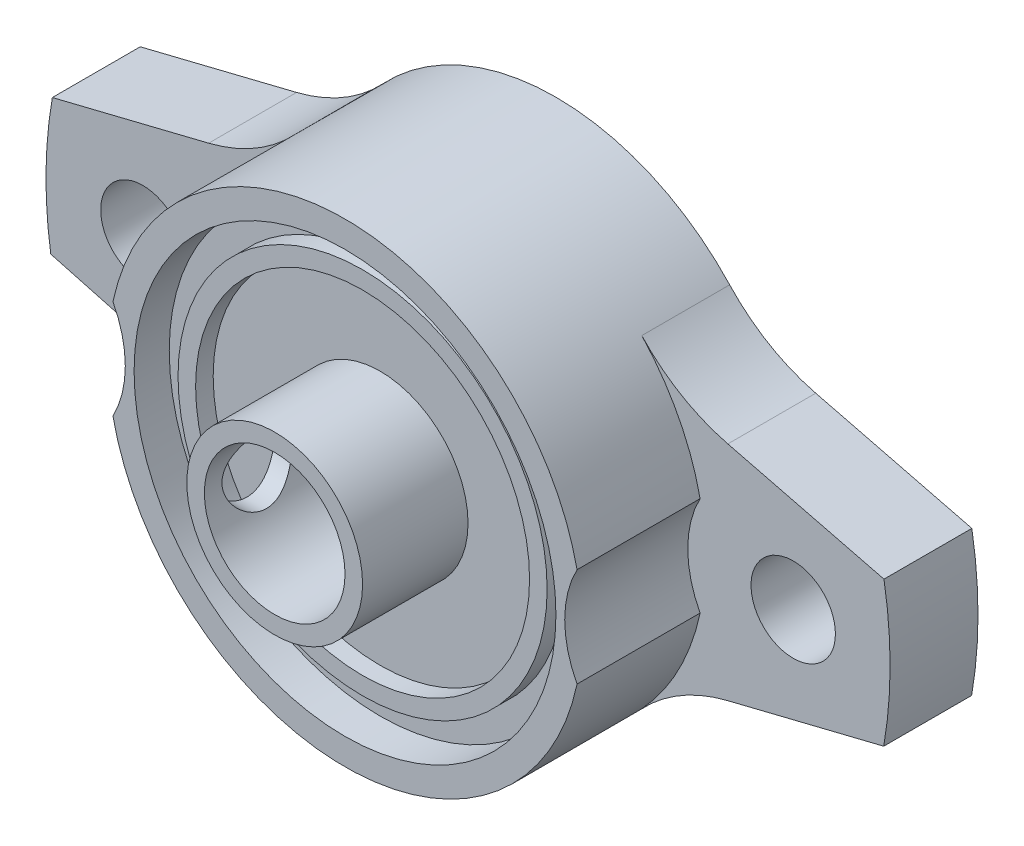
ISO-10303-21;
HEADER;
FILE_DESCRIPTION(('STEP AP214'),'2;1');
FILE_NAME('part.step','',(''),(''),'','','');
FILE_SCHEMA(('AUTOMOTIVE_DESIGN { 1 0 10303 214 1 1 1 1 }'));
ENDSEC;
DATA;
#1=APPLICATION_CONTEXT('core data for automotive mechanical design processes');
#2=APPLICATION_PROTOCOL_DEFINITION('international standard','automotive_design',2000,#1);
#3=PRODUCT_CONTEXT('',#1,'mechanical');
#4=PRODUCT('Part','Part','',(#3));
#5=PRODUCT_RELATED_PRODUCT_CATEGORY('part','',(#4));
#6=PRODUCT_DEFINITION_FORMATION('','',#4);
#7=PRODUCT_DEFINITION_CONTEXT('part definition',#1,'design');
#8=PRODUCT_DEFINITION('design','',#6,#7);
#9=PRODUCT_DEFINITION_SHAPE('','',#8);
#10=(LENGTH_UNIT() NAMED_UNIT(*) SI_UNIT(.MILLI.,.METRE.));
#11=(NAMED_UNIT(*) PLANE_ANGLE_UNIT() SI_UNIT($,.RADIAN.));
#12=(NAMED_UNIT(*) SI_UNIT($,.STERADIAN.) SOLID_ANGLE_UNIT());
#13=UNCERTAINTY_MEASURE_WITH_UNIT(LENGTH_MEASURE(1.E-05),#10,'distance_accuracy_value','');
#14=(GEOMETRIC_REPRESENTATION_CONTEXT(3) GLOBAL_UNCERTAINTY_ASSIGNED_CONTEXT((#13)) GLOBAL_UNIT_ASSIGNED_CONTEXT((#10,
#11,#12)) REPRESENTATION_CONTEXT('',''));
#15=CARTESIAN_POINT('',(0.,0.,0.));
#16=DIRECTION('',(0.,0.,1.));
#17=DIRECTION('',(1.,0.,0.));
#18=AXIS2_PLACEMENT_3D('',#15,#16,#17);
#19=CARTESIAN_POINT('',(0.,0.,10.));
#20=DIRECTION('',(0.,0.,1.));
#21=DIRECTION('',(1.,0.,0.));
#22=AXIS2_PLACEMENT_3D('',#19,#20,#21);
#23=PLANE('',#22);
#24=CARTESIAN_POINT('',(0.,0.,10.));
#25=DIRECTION('',(0.,0.,1.));
#26=DIRECTION('',(1.,0.,0.));
#27=AXIS2_PLACEMENT_3D('',#24,#25,#26);
#28=CIRCLE('',#27,5.);
#29=CARTESIAN_POINT('',(5.,0.,10.));
#30=VERTEX_POINT('',#29);
#31=EDGE_CURVE('E372',#30,#30,#28,.T.);
#32=ORIENTED_EDGE('',*,*,#31,.F.);
#33=EDGE_LOOP('',(#32));
#34=FACE_BOUND('',#33,.T.);
#35=CARTESIAN_POINT('',(0.,0.,10.));
#36=DIRECTION('',(0.,0.,1.));
#37=DIRECTION('',(1.,0.,0.));
#38=AXIS2_PLACEMENT_3D('',#35,#36,#37);
#39=CIRCLE('',#38,9.5);
#40=CARTESIAN_POINT('',(9.5,0.,10.));
#41=VERTEX_POINT('',#40);
#42=EDGE_CURVE('E11',#41,#41,#39,.F.);
#43=ORIENTED_EDGE('',*,*,#42,.F.);
#44=EDGE_LOOP('',(#43));
#45=FACE_BOUND('',#44,.T.);
#46=ADVANCED_FACE('F39',(#34,#45),#23,.T.);
#47=CARTESIAN_POINT('',(0.,0.,5.));
#48=DIRECTION('',(0.,0.,-1.));
#49=DIRECTION('',(-1.,0.,0.));
#50=AXIS2_PLACEMENT_3D('',#47,#48,#49);
#51=CYLINDRICAL_SURFACE('',#50,13.5);
#52=DIRECTION('',(0.,0.,-1.));
#53=VECTOR('',#52,1.);
#54=CARTESIAN_POINT('',(-13.2027027027027,2.81755946592911,8.5));
#55=LINE('',#54,#53);
#56=CARTESIAN_POINT('',(-13.2027027027027,2.81755946592911,12.));
#57=VERTEX_POINT('',#56);
#58=CARTESIAN_POINT('',(-13.2027027027027,2.81755946592911,5.));
#59=VERTEX_POINT('',#58);
#60=EDGE_CURVE('E365',#57,#59,#55,.T.);
#61=ORIENTED_EDGE('',*,*,#60,.F.);
#62=CARTESIAN_POINT('',(0.,0.,12.));
#63=DIRECTION('',(0.,0.,1.));
#64=DIRECTION('',(1.,0.,0.));
#65=AXIS2_PLACEMENT_3D('',#62,#63,#64);
#66=CIRCLE('',#65,13.5);
#67=CARTESIAN_POINT('',(13.2027027027027,2.81755946592911,12.));
#68=VERTEX_POINT('',#67);
#69=EDGE_CURVE('E181',#68,#57,#66,.T.);
#70=ORIENTED_EDGE('',*,*,#69,.F.);
#71=DIRECTION('',(0.,0.,-1.));
#72=VECTOR('',#71,1.);
#73=CARTESIAN_POINT('',(13.2027027027027,2.81755946592912,8.5));
#74=LINE('',#73,#72);
#75=CARTESIAN_POINT('',(13.2027027027027,2.81755946592912,5.));
#76=VERTEX_POINT('',#75);
#77=EDGE_CURVE('E69',#76,#68,#74,.F.);
#78=ORIENTED_EDGE('',*,*,#77,.F.);
#79=CARTESIAN_POINT('',(0.,0.,5.));
#80=DIRECTION('',(0.,0.,1.));
#81=DIRECTION('',(1.,0.,0.));
#82=AXIS2_PLACEMENT_3D('',#79,#80,#81);
#83=CIRCLE('',#82,13.5);
#84=CARTESIAN_POINT('',(9.88488307514871,9.19451393987951,5.));
#85=VERTEX_POINT('',#84);
#86=EDGE_CURVE('E198',#76,#85,#83,.T.);
#87=ORIENTED_EDGE('',*,*,#86,.T.);
#88=DIRECTION('',(0.,0.,-1.));
#89=VECTOR('',#88,1.);
#90=CARTESIAN_POINT('',(9.88488307514871,9.1945139398795,5.));
#91=LINE('',#90,#89);
#92=CARTESIAN_POINT('',(9.88488307514871,9.1945139398795,0.));
#93=VERTEX_POINT('',#92);
#94=EDGE_CURVE('E288',#85,#93,#91,.T.);
#95=ORIENTED_EDGE('',*,*,#94,.T.);
#96=CARTESIAN_POINT('',(0.,0.,0.));
#97=DIRECTION('',(0.,0.,1.));
#98=DIRECTION('',(1.,0.,0.));
#99=AXIS2_PLACEMENT_3D('',#96,#97,#98);
#100=CIRCLE('',#99,13.5);
#101=CARTESIAN_POINT('',(-9.85452897471219,9.22703954074966,0.));
#102=VERTEX_POINT('',#101);
#103=EDGE_CURVE('E220',#93,#102,#100,.T.);
#104=ORIENTED_EDGE('',*,*,#103,.T.);
#105=DIRECTION('',(0.,0.,-1.));
#106=VECTOR('',#105,1.);
#107=CARTESIAN_POINT('',(-9.85452897471219,9.22703954074966,5.));
#108=LINE('',#107,#106);
#109=CARTESIAN_POINT('',(-9.85452897471219,9.22703954074966,5.));
#110=VERTEX_POINT('',#109);
#111=EDGE_CURVE('E249',#110,#102,#108,.T.);
#112=ORIENTED_EDGE('',*,*,#111,.F.);
#113=EDGE_CURVE('E192',#110,#59,#83,.T.);
#114=ORIENTED_EDGE('',*,*,#113,.T.);
#115=EDGE_LOOP('',(#61,#70,#78,#87,#95,#104,#112,#114));
#116=FACE_BOUND('',#115,.T.);
#117=ADVANCED_FACE('F383',(#116),#51,.T.);
#118=DIRECTION('',(0.,0.,-1.));
#119=VECTOR('',#118,1.);
#120=CARTESIAN_POINT('',(-13.2027027027027,-2.81755946592911,8.5));
#121=LINE('',#120,#119);
#122=CARTESIAN_POINT('',(-13.2027027027027,-2.81755946592911,5.));
#123=VERTEX_POINT('',#122);
#124=CARTESIAN_POINT('',(-13.2027027027027,-2.81755946592911,12.));
#125=VERTEX_POINT('',#124);
#126=EDGE_CURVE('E61',#123,#125,#121,.F.);
#127=ORIENTED_EDGE('',*,*,#126,.F.);
#128=CARTESIAN_POINT('',(-10.0813645713589,-8.97864624424808,5.));
#129=VERTEX_POINT('',#128);
#130=EDGE_CURVE('E197',#123,#129,#83,.T.);
#131=ORIENTED_EDGE('',*,*,#130,.T.);
#132=DIRECTION('',(0.,0.,-1.));
#133=VECTOR('',#132,1.);
#134=CARTESIAN_POINT('',(-10.0813645713589,-8.97864624424808,5.));
#135=LINE('',#134,#133);
#136=CARTESIAN_POINT('',(-10.0813645713589,-8.97864624424808,0.));
#137=VERTEX_POINT('',#136);
#138=EDGE_CURVE('E312',#129,#137,#135,.T.);
#139=ORIENTED_EDGE('',*,*,#138,.T.);
#140=CARTESIAN_POINT('',(0.,0.,0.));
#141=DIRECTION('',(0.,0.,1.));
#142=DIRECTION('',(1.,0.,0.));
#143=AXIS2_PLACEMENT_3D('',#140,#141,#142);
#144=CIRCLE('',#143,13.5);
#145=CARTESIAN_POINT('',(9.85452897471219,-9.22703954074967,0.));
#146=VERTEX_POINT('',#145);
#147=EDGE_CURVE('E265',#137,#146,#144,.T.);
#148=ORIENTED_EDGE('',*,*,#147,.T.);
#149=DIRECTION('',(0.,0.,-1.));
#150=VECTOR('',#149,1.);
#151=CARTESIAN_POINT('',(9.85452897471219,-9.22703954074967,5.));
#152=LINE('',#151,#150);
#153=CARTESIAN_POINT('',(9.85452897471219,-9.22703954074967,5.));
#154=VERTEX_POINT('',#153);
#155=EDGE_CURVE('E308',#154,#146,#152,.T.);
#156=ORIENTED_EDGE('',*,*,#155,.F.);
#157=CARTESIAN_POINT('',(13.2027027027027,-2.81755946592912,5.));
#158=VERTEX_POINT('',#157);
#159=EDGE_CURVE('E175',#154,#158,#83,.T.);
#160=ORIENTED_EDGE('',*,*,#159,.T.);
#161=DIRECTION('',(0.,0.,-1.));
#162=VECTOR('',#161,1.);
#163=CARTESIAN_POINT('',(13.2027027027027,-2.81755946592912,8.5));
#164=LINE('',#163,#162);
#165=CARTESIAN_POINT('',(13.2027027027027,-2.81755946592911,12.));
#166=VERTEX_POINT('',#165);
#167=EDGE_CURVE('E159',#166,#158,#164,.T.);
#168=ORIENTED_EDGE('',*,*,#167,.F.);
#169=EDGE_CURVE('E173',#125,#166,#66,.T.);
#170=ORIENTED_EDGE('',*,*,#169,.F.);
#171=EDGE_LOOP('',(#127,#131,#139,#148,#156,#160,#168,#170));
#172=FACE_BOUND('',#171,.T.);
#173=ADVANCED_FACE('F172',(#172),#51,.T.);
#174=CARTESIAN_POINT('',(-17.1541800670916,16.0618836450087,5.));
#175=DIRECTION('',(0.,0.,-1.));
#176=DIRECTION('',(-1.,0.,0.));
#177=AXIS2_PLACEMENT_3D('',#174,#175,#176);
#178=PLANE('',#177);
#179=CARTESIAN_POINT('',(0.,0.,5.));
#180=DIRECTION('',(0.,0.,1.));
#181=DIRECTION('',(1.,0.,0.));
#182=AXIS2_PLACEMENT_3D('',#179,#180,#181);
#183=CIRCLE('',#182,24.0128654701383);
#184=CARTESIAN_POINT('',(-23.6505156212033,4.15581748133644,5.));
#185=VERTEX_POINT('',#184);
#186=CARTESIAN_POINT('',(-23.7406652362786,-3.60534633924577,5.));
#187=VERTEX_POINT('',#186);
#188=EDGE_CURVE('E223',#185,#187,#183,.T.);
#189=ORIENTED_EDGE('',*,*,#188,.T.);
#190=DIRECTION('',(0.965585774161579,-0.260084818351216,0.));
#191=VECTOR('',#190,1.);
#192=CARTESIAN_POINT('',(-23.7406652362786,-3.60534633924577,5.));
#193=LINE('',#192,#191);
#194=CARTESIAN_POINT('',(-14.9481938481125,-5.9736375724457,5.));
#195=VERTEX_POINT('',#194);
#196=EDGE_CURVE('E226',#187,#195,#193,.T.);
#197=ORIENTED_EDGE('',*,*,#196,.T.);
#198=CARTESIAN_POINT('',(-17.5490420316247,-15.6294953140615,5.));
#199=DIRECTION('',(0.,0.,-1.));
#200=DIRECTION('',(1.,0.,0.));
#201=AXIS2_PLACEMENT_3D('',#198,#199,#200);
#202=CIRCLE('',#201,10.);
#203=EDGE_CURVE('E229',#195,#129,#202,.T.);
#204=ORIENTED_EDGE('',*,*,#203,.T.);
#205=ORIENTED_EDGE('',*,*,#130,.F.);
#206=CARTESIAN_POINT('',(-18.5,0.,5.));
#207=DIRECTION('',(0.,0.,1.));
#208=DIRECTION('',(1.,0.,0.));
#209=AXIS2_PLACEMENT_3D('',#206,#207,#208);
#210=CIRCLE('',#209,6.);
#211=EDGE_CURVE('E166',#123,#59,#210,.T.);
#212=ORIENTED_EDGE('',*,*,#211,.T.);
#213=ORIENTED_EDGE('',*,*,#113,.F.);
#214=CARTESIAN_POINT('',(-17.1541800670916,16.0618836450087,5.));
#215=DIRECTION('',(0.,0.,-1.));
#216=DIRECTION('',(-1.,0.,0.));
#217=AXIS2_PLACEMENT_3D('',#214,#215,#216);
#218=CIRCLE('',#217,10.);
#219=CARTESIAN_POINT('',(-14.7552758263765,6.35388393117065,5.));
#220=VERTEX_POINT('',#219);
#221=EDGE_CURVE('E215',#110,#220,#218,.T.);
#222=ORIENTED_EDGE('',*,*,#221,.T.);
#223=DIRECTION('',(-0.970799971383802,-0.239890424071509,0.));
#224=VECTOR('',#223,1.);
#225=CARTESIAN_POINT('',(-23.6505156212033,4.15581748133643,5.));
#226=LINE('',#225,#224);
#227=EDGE_CURVE('E219',#220,#185,#226,.T.);
#228=ORIENTED_EDGE('',*,*,#227,.T.);
#229=EDGE_LOOP('',(#189,#197,#204,#205,#212,#213,#222,#228));
#230=FACE_BOUND('',#229,.T.);
#231=CARTESIAN_POINT('',(-18.5,0.,5.));
#232=DIRECTION('',(0.,0.,1.));
#233=DIRECTION('',(1.,0.,0.));
#234=AXIS2_PLACEMENT_3D('',#231,#232,#233);
#235=CIRCLE('',#234,2.4);
#236=CARTESIAN_POINT('',(-16.1,0.,5.));
#237=VERTEX_POINT('',#236);
#238=EDGE_CURVE('E199',#237,#237,#235,.T.);
#239=ORIENTED_EDGE('',*,*,#238,.F.);
#240=EDGE_LOOP('',(#239));
#241=FACE_BOUND('',#240,.T.);
#242=ADVANCED_FACE('F464',(#230,#241),#178,.F.);
#243=ORIENTED_EDGE('',*,*,#86,.F.);
#244=CARTESIAN_POINT('',(18.5,0.,5.));
#245=DIRECTION('',(0.,0.,1.));
#246=DIRECTION('',(1.,0.,0.));
#247=AXIS2_PLACEMENT_3D('',#244,#245,#246);
#248=CIRCLE('',#247,6.);
#249=EDGE_CURVE('E167',#76,#158,#248,.T.);
#250=ORIENTED_EDGE('',*,*,#249,.T.);
#251=ORIENTED_EDGE('',*,*,#159,.F.);
#252=CARTESIAN_POINT('',(17.1541800670916,-16.0618836450087,5.));
#253=DIRECTION('',(0.,0.,-1.));
#254=DIRECTION('',(1.,0.,0.));
#255=AXIS2_PLACEMENT_3D('',#252,#253,#254);
#256=CIRCLE('',#255,10.);
#257=CARTESIAN_POINT('',(14.7552758263765,-6.35388393117066,5.));
#258=VERTEX_POINT('',#257);
#259=EDGE_CURVE('E233',#154,#258,#256,.T.);
#260=ORIENTED_EDGE('',*,*,#259,.T.);
#261=DIRECTION('',(0.970799971383802,0.239890424071509,0.));
#262=VECTOR('',#261,1.);
#263=CARTESIAN_POINT('',(14.7552758263765,-6.35388393117066,5.));
#264=LINE('',#263,#262);
#265=CARTESIAN_POINT('',(23.6505156212033,-4.15581748133645,5.));
#266=VERTEX_POINT('',#265);
#267=EDGE_CURVE('E236',#258,#266,#264,.T.);
#268=ORIENTED_EDGE('',*,*,#267,.T.);
#269=CARTESIAN_POINT('',(0.,0.,5.));
#270=DIRECTION('',(0.,0.,1.));
#271=DIRECTION('',(1.,0.,0.));
#272=AXIS2_PLACEMENT_3D('',#269,#270,#271);
#273=CIRCLE('',#272,24.0128654701383);
#274=CARTESIAN_POINT('',(23.6631937463066,4.08300989610819,5.));
#275=VERTEX_POINT('',#274);
#276=EDGE_CURVE('E239',#266,#275,#273,.T.);
#277=ORIENTED_EDGE('',*,*,#276,.T.);
#278=DIRECTION('',(-0.970131003681206,0.242581606261677,0.));
#279=VECTOR('',#278,1.);
#280=CARTESIAN_POINT('',(14.7812026237532,6.30395496964486,5.));
#281=LINE('',#280,#279);
#282=CARTESIAN_POINT('',(14.7812026237532,6.30395496964486,5.));
#283=VERTEX_POINT('',#282);
#284=EDGE_CURVE('E242',#275,#283,#281,.T.);
#285=ORIENTED_EDGE('',*,*,#284,.T.);
#286=CARTESIAN_POINT('',(17.20701868637,16.0052650064569,5.));
#287=DIRECTION('',(0.,0.,-1.));
#288=DIRECTION('',(-1.,0.,0.));
#289=AXIS2_PLACEMENT_3D('',#286,#287,#288);
#290=CIRCLE('',#289,10.);
#291=EDGE_CURVE('E245',#283,#85,#290,.T.);
#292=ORIENTED_EDGE('',*,*,#291,.T.);
#293=EDGE_LOOP('',(#243,#250,#251,#260,#268,#277,#285,#292));
#294=FACE_BOUND('',#293,.T.);
#295=CARTESIAN_POINT('',(18.5,0.,5.));
#296=DIRECTION('',(0.,0.,1.));
#297=DIRECTION('',(1.,0.,0.));
#298=AXIS2_PLACEMENT_3D('',#295,#296,#297);
#299=CIRCLE('',#298,2.4);
#300=CARTESIAN_POINT('',(20.9,0.,5.));
#301=VERTEX_POINT('',#300);
#302=EDGE_CURVE('E207',#301,#301,#299,.T.);
#303=ORIENTED_EDGE('',*,*,#302,.F.);
#304=EDGE_LOOP('',(#303));
#305=FACE_BOUND('',#304,.T.);
#306=ADVANCED_FACE('F460',(#294,#305),#178,.F.);
#307=CARTESIAN_POINT('',(-17.1541800670916,16.0618836450087,0.));
#308=DIRECTION('',(0.,0.,-1.));
#309=DIRECTION('',(-1.,0.,0.));
#310=AXIS2_PLACEMENT_3D('',#307,#308,#309);
#311=PLANE('',#310);
#312=CARTESIAN_POINT('',(0.,0.,0.));
#313=DIRECTION('',(0.,0.,-1.));
#314=DIRECTION('',(-1.,0.,0.));
#315=AXIS2_PLACEMENT_3D('',#312,#313,#314);
#316=CIRCLE('',#315,4.);
#317=CARTESIAN_POINT('',(-4.,0.,0.));
#318=VERTEX_POINT('',#317);
#319=EDGE_CURVE('E337',#318,#318,#316,.T.);
#320=ORIENTED_EDGE('',*,*,#319,.F.);
#321=EDGE_LOOP('',(#320));
#322=FACE_BOUND('',#321,.T.);
#323=CARTESIAN_POINT('',(18.5,0.,0.));
#324=DIRECTION('',(0.,0.,1.));
#325=DIRECTION('',(1.,0.,0.));
#326=AXIS2_PLACEMENT_3D('',#323,#324,#325);
#327=CIRCLE('',#326,2.4);
#328=CARTESIAN_POINT('',(20.9,0.,0.));
#329=VERTEX_POINT('',#328);
#330=EDGE_CURVE('E203',#329,#329,#327,.T.);
#331=ORIENTED_EDGE('',*,*,#330,.T.);
#332=EDGE_LOOP('',(#331));
#333=FACE_BOUND('',#332,.T.);
#334=CARTESIAN_POINT('',(-17.1541800670916,16.0618836450087,0.));
#335=DIRECTION('',(0.,0.,-1.));
#336=DIRECTION('',(-1.,0.,0.));
#337=AXIS2_PLACEMENT_3D('',#334,#335,#336);
#338=CIRCLE('',#337,10.);
#339=CARTESIAN_POINT('',(-14.7552758263765,6.35388393117065,0.));
#340=VERTEX_POINT('',#339);
#341=EDGE_CURVE('E211',#102,#340,#338,.T.);
#342=ORIENTED_EDGE('',*,*,#341,.F.);
#343=ORIENTED_EDGE('',*,*,#103,.F.);
#344=CARTESIAN_POINT('',(17.20701868637,16.0052650064569,0.));
#345=DIRECTION('',(0.,0.,-1.));
#346=DIRECTION('',(-1.,0.,0.));
#347=AXIS2_PLACEMENT_3D('',#344,#345,#346);
#348=CIRCLE('',#347,10.);
#349=CARTESIAN_POINT('',(14.7812026237532,6.30395496964486,0.));
#350=VERTEX_POINT('',#349);
#351=EDGE_CURVE('E280',#350,#93,#348,.T.);
#352=ORIENTED_EDGE('',*,*,#351,.F.);
#353=DIRECTION('',(-0.970131003681206,0.242581606261677,0.));
#354=VECTOR('',#353,1.);
#355=CARTESIAN_POINT('',(14.7812026237532,6.30395496964486,0.));
#356=LINE('',#355,#354);
#357=CARTESIAN_POINT('',(23.6631937463066,4.08300989610819,0.));
#358=VERTEX_POINT('',#357);
#359=EDGE_CURVE('E277',#358,#350,#356,.T.);
#360=ORIENTED_EDGE('',*,*,#359,.F.);
#361=CARTESIAN_POINT('',(0.,0.,0.));
#362=DIRECTION('',(0.,0.,1.));
#363=DIRECTION('',(1.,0.,0.));
#364=AXIS2_PLACEMENT_3D('',#361,#362,#363);
#365=CIRCLE('',#364,24.0128654701383);
#366=CARTESIAN_POINT('',(23.6505156212033,-4.15581748133645,0.));
#367=VERTEX_POINT('',#366);
#368=EDGE_CURVE('E274',#367,#358,#365,.T.);
#369=ORIENTED_EDGE('',*,*,#368,.F.);
#370=DIRECTION('',(0.970799971383802,0.239890424071509,0.));
#371=VECTOR('',#370,1.);
#372=CARTESIAN_POINT('',(14.7552758263765,-6.35388393117066,0.));
#373=LINE('',#372,#371);
#374=CARTESIAN_POINT('',(14.7552758263765,-6.35388393117066,0.));
#375=VERTEX_POINT('',#374);
#376=EDGE_CURVE('E271',#375,#367,#373,.T.);
#377=ORIENTED_EDGE('',*,*,#376,.F.);
#378=CARTESIAN_POINT('',(17.1541800670916,-16.0618836450087,0.));
#379=DIRECTION('',(0.,0.,-1.));
#380=DIRECTION('',(1.,0.,0.));
#381=AXIS2_PLACEMENT_3D('',#378,#379,#380);
#382=CIRCLE('',#381,10.);
#383=EDGE_CURVE('E268',#146,#375,#382,.T.);
#384=ORIENTED_EDGE('',*,*,#383,.F.);
#385=ORIENTED_EDGE('',*,*,#147,.F.);
#386=CARTESIAN_POINT('',(-17.5490420316247,-15.6294953140615,0.));
#387=DIRECTION('',(0.,0.,-1.));
#388=DIRECTION('',(1.,0.,0.));
#389=AXIS2_PLACEMENT_3D('',#386,#387,#388);
#390=CIRCLE('',#389,10.);
#391=CARTESIAN_POINT('',(-14.9481938481125,-5.9736375724457,0.));
#392=VERTEX_POINT('',#391);
#393=EDGE_CURVE('E262',#392,#137,#390,.T.);
#394=ORIENTED_EDGE('',*,*,#393,.F.);
#395=DIRECTION('',(0.965585774161579,-0.260084818351216,0.));
#396=VECTOR('',#395,1.);
#397=CARTESIAN_POINT('',(-23.7406652362786,-3.60534633924577,0.));
#398=LINE('',#397,#396);
#399=CARTESIAN_POINT('',(-23.7406652362786,-3.60534633924577,0.));
#400=VERTEX_POINT('',#399);
#401=EDGE_CURVE('E259',#400,#392,#398,.T.);
#402=ORIENTED_EDGE('',*,*,#401,.F.);
#403=CARTESIAN_POINT('',(0.,0.,0.));
#404=DIRECTION('',(0.,0.,1.));
#405=DIRECTION('',(1.,0.,0.));
#406=AXIS2_PLACEMENT_3D('',#403,#404,#405);
#407=CIRCLE('',#406,24.0128654701383);
#408=CARTESIAN_POINT('',(-23.6505156212033,4.15581748133644,0.));
#409=VERTEX_POINT('',#408);
#410=EDGE_CURVE('E256',#409,#400,#407,.T.);
#411=ORIENTED_EDGE('',*,*,#410,.F.);
#412=DIRECTION('',(-0.970799971383802,-0.239890424071509,0.));
#413=VECTOR('',#412,1.);
#414=CARTESIAN_POINT('',(-23.6505156212033,4.15581748133643,0.));
#415=LINE('',#414,#413);
#416=EDGE_CURVE('E253',#340,#409,#415,.T.);
#417=ORIENTED_EDGE('',*,*,#416,.F.);
#418=EDGE_LOOP('',(#342,#343,#352,#360,#369,#377,#384,#385,#394,#402,#411,#417));
#419=FACE_BOUND('',#418,.T.);
#420=CARTESIAN_POINT('',(-18.5,0.,0.));
#421=DIRECTION('',(0.,0.,1.));
#422=DIRECTION('',(1.,0.,0.));
#423=AXIS2_PLACEMENT_3D('',#420,#421,#422);
#424=CIRCLE('',#423,2.4);
#425=CARTESIAN_POINT('',(-16.1,0.,0.));
#426=VERTEX_POINT('',#425);
#427=EDGE_CURVE('E186',#426,#426,#424,.T.);
#428=ORIENTED_EDGE('',*,*,#427,.T.);
#429=EDGE_LOOP('',(#428));
#430=FACE_BOUND('',#429,.T.);
#431=ADVANCED_FACE('F463',(#322,#333,#419,#430),#311,.T.);
#432=CARTESIAN_POINT('',(-17.1541800670916,16.0618836450087,5.));
#433=DIRECTION('',(0.,0.,-1.));
#434=DIRECTION('',(-1.,0.,0.));
#435=AXIS2_PLACEMENT_3D('',#432,#433,#434);
#436=CYLINDRICAL_SURFACE('',#435,10.);
#437=ORIENTED_EDGE('',*,*,#341,.T.);
#438=DIRECTION('',(0.,0.,-1.));
#439=VECTOR('',#438,1.);
#440=CARTESIAN_POINT('',(-14.7552758263765,6.35388393117065,5.));
#441=LINE('',#440,#439);
#442=EDGE_CURVE('E328',#220,#340,#441,.T.);
#443=ORIENTED_EDGE('',*,*,#442,.F.);
#444=ORIENTED_EDGE('',*,*,#221,.F.);
#445=ORIENTED_EDGE('',*,*,#111,.T.);
#446=EDGE_LOOP('',(#437,#443,#444,#445));
#447=FACE_BOUND('',#446,.T.);
#448=ADVANCED_FACE('F41',(#447),#436,.F.);
#449=CARTESIAN_POINT('',(-23.6505156212033,4.15581748133643,5.));
#450=DIRECTION('',(0.239890424071509,-0.970799971383802,0.));
#451=DIRECTION('',(0.970799971383802,0.239890424071509,0.));
#452=AXIS2_PLACEMENT_3D('',#449,#450,#451);
#453=PLANE('',#452);
#454=ORIENTED_EDGE('',*,*,#416,.T.);
#455=DIRECTION('',(0.,0.,-1.));
#456=VECTOR('',#455,1.);
#457=CARTESIAN_POINT('',(-23.6505156212033,4.15581748133644,5.));
#458=LINE('',#457,#456);
#459=EDGE_CURVE('E324',#185,#409,#458,.T.);
#460=ORIENTED_EDGE('',*,*,#459,.F.);
#461=ORIENTED_EDGE('',*,*,#227,.F.);
#462=ORIENTED_EDGE('',*,*,#442,.T.);
#463=EDGE_LOOP('',(#454,#460,#461,#462));
#464=FACE_BOUND('',#463,.T.);
#465=ADVANCED_FACE('F501',(#464),#453,.F.);
#466=CARTESIAN_POINT('',(0.,0.,5.));
#467=DIRECTION('',(0.,0.,-1.));
#468=DIRECTION('',(-1.,0.,0.));
#469=AXIS2_PLACEMENT_3D('',#466,#467,#468);
#470=CYLINDRICAL_SURFACE('',#469,24.0128654701383);
#471=ORIENTED_EDGE('',*,*,#410,.T.);
#472=DIRECTION('',(0.,0.,-1.));
#473=VECTOR('',#472,1.);
#474=CARTESIAN_POINT('',(-23.7406652362786,-3.60534633924577,5.));
#475=LINE('',#474,#473);
#476=EDGE_CURVE('E320',#187,#400,#475,.T.);
#477=ORIENTED_EDGE('',*,*,#476,.F.);
#478=ORIENTED_EDGE('',*,*,#188,.F.);
#479=ORIENTED_EDGE('',*,*,#459,.T.);
#480=EDGE_LOOP('',(#471,#477,#478,#479));
#481=FACE_BOUND('',#480,.T.);
#482=ADVANCED_FACE('F498',(#481),#470,.T.);
#483=CARTESIAN_POINT('',(-23.7406652362786,-3.60534633924577,5.));
#484=DIRECTION('',(0.260084818351216,0.965585774161579,0.));
#485=DIRECTION('',(-0.965585774161579,0.260084818351216,0.));
#486=AXIS2_PLACEMENT_3D('',#483,#484,#485);
#487=PLANE('',#486);
#488=ORIENTED_EDGE('',*,*,#401,.T.);
#489=DIRECTION('',(0.,0.,-1.));
#490=VECTOR('',#489,1.);
#491=CARTESIAN_POINT('',(-14.9481938481125,-5.9736375724457,5.));
#492=LINE('',#491,#490);
#493=EDGE_CURVE('E316',#195,#392,#492,.T.);
#494=ORIENTED_EDGE('',*,*,#493,.F.);
#495=ORIENTED_EDGE('',*,*,#196,.F.);
#496=ORIENTED_EDGE('',*,*,#476,.T.);
#497=EDGE_LOOP('',(#488,#494,#495,#496));
#498=FACE_BOUND('',#497,.T.);
#499=ADVANCED_FACE('F494',(#498),#487,.F.);
#500=CARTESIAN_POINT('',(-17.5490420316247,-15.6294953140615,5.));
#501=DIRECTION('',(0.,0.,-1.));
#502=DIRECTION('',(-1.,0.,0.));
#503=AXIS2_PLACEMENT_3D('',#500,#501,#502);
#504=CYLINDRICAL_SURFACE('',#503,10.);
#505=ORIENTED_EDGE('',*,*,#393,.T.);
#506=ORIENTED_EDGE('',*,*,#138,.F.);
#507=ORIENTED_EDGE('',*,*,#203,.F.);
#508=ORIENTED_EDGE('',*,*,#493,.T.);
#509=EDGE_LOOP('',(#505,#506,#507,#508));
#510=FACE_BOUND('',#509,.T.);
#511=ADVANCED_FACE('F490',(#510),#504,.F.);
#512=CARTESIAN_POINT('',(17.1541800670916,-16.0618836450087,5.));
#513=DIRECTION('',(0.,0.,-1.));
#514=DIRECTION('',(-1.,0.,0.));
#515=AXIS2_PLACEMENT_3D('',#512,#513,#514);
#516=CYLINDRICAL_SURFACE('',#515,10.);
#517=ORIENTED_EDGE('',*,*,#383,.T.);
#518=DIRECTION('',(0.,0.,-1.));
#519=VECTOR('',#518,1.);
#520=CARTESIAN_POINT('',(14.7552758263765,-6.35388393117066,5.));
#521=LINE('',#520,#519);
#522=EDGE_CURVE('E304',#258,#375,#521,.T.);
#523=ORIENTED_EDGE('',*,*,#522,.F.);
#524=ORIENTED_EDGE('',*,*,#259,.F.);
#525=ORIENTED_EDGE('',*,*,#155,.T.);
#526=EDGE_LOOP('',(#517,#523,#524,#525));
#527=FACE_BOUND('',#526,.T.);
#528=ADVANCED_FACE('F486',(#527),#516,.F.);
#529=CARTESIAN_POINT('',(14.7552758263765,-6.35388393117066,5.));
#530=DIRECTION('',(-0.239890424071509,0.970799971383802,0.));
#531=DIRECTION('',(-0.970799971383802,-0.239890424071509,0.));
#532=AXIS2_PLACEMENT_3D('',#529,#530,#531);
#533=PLANE('',#532);
#534=ORIENTED_EDGE('',*,*,#376,.T.);
#535=DIRECTION('',(0.,0.,-1.));
#536=VECTOR('',#535,1.);
#537=CARTESIAN_POINT('',(23.6505156212033,-4.15581748133645,5.));
#538=LINE('',#537,#536);
#539=EDGE_CURVE('E300',#266,#367,#538,.T.);
#540=ORIENTED_EDGE('',*,*,#539,.F.);
#541=ORIENTED_EDGE('',*,*,#267,.F.);
#542=ORIENTED_EDGE('',*,*,#522,.T.);
#543=EDGE_LOOP('',(#534,#540,#541,#542));
#544=FACE_BOUND('',#543,.T.);
#545=ADVANCED_FACE('F482',(#544),#533,.F.);
#546=CARTESIAN_POINT('',(0.,0.,5.));
#547=DIRECTION('',(0.,0.,-1.));
#548=DIRECTION('',(-1.,0.,0.));
#549=AXIS2_PLACEMENT_3D('',#546,#547,#548);
#550=CYLINDRICAL_SURFACE('',#549,24.0128654701383);
#551=ORIENTED_EDGE('',*,*,#368,.T.);
#552=DIRECTION('',(0.,0.,-1.));
#553=VECTOR('',#552,1.);
#554=CARTESIAN_POINT('',(23.6631937463066,4.08300989610819,5.));
#555=LINE('',#554,#553);
#556=EDGE_CURVE('E296',#275,#358,#555,.T.);
#557=ORIENTED_EDGE('',*,*,#556,.F.);
#558=ORIENTED_EDGE('',*,*,#276,.F.);
#559=ORIENTED_EDGE('',*,*,#539,.T.);
#560=EDGE_LOOP('',(#551,#557,#558,#559));
#561=FACE_BOUND('',#560,.T.);
#562=ADVANCED_FACE('F478',(#561),#550,.T.);
#563=CARTESIAN_POINT('',(14.7812026237532,6.30395496964486,5.));
#564=DIRECTION('',(-0.242581606261677,-0.970131003681206,0.));
#565=DIRECTION('',(0.970131003681206,-0.242581606261677,0.));
#566=AXIS2_PLACEMENT_3D('',#563,#564,#565);
#567=PLANE('',#566);
#568=ORIENTED_EDGE('',*,*,#359,.T.);
#569=DIRECTION('',(0.,0.,-1.));
#570=VECTOR('',#569,1.);
#571=CARTESIAN_POINT('',(14.7812026237532,6.30395496964486,5.));
#572=LINE('',#571,#570);
#573=EDGE_CURVE('E292',#283,#350,#572,.T.);
#574=ORIENTED_EDGE('',*,*,#573,.F.);
#575=ORIENTED_EDGE('',*,*,#284,.F.);
#576=ORIENTED_EDGE('',*,*,#556,.T.);
#577=EDGE_LOOP('',(#568,#574,#575,#576));
#578=FACE_BOUND('',#577,.T.);
#579=ADVANCED_FACE('F474',(#578),#567,.F.);
#580=CARTESIAN_POINT('',(17.20701868637,16.0052650064569,5.));
#581=DIRECTION('',(0.,0.,-1.));
#582=DIRECTION('',(-1.,0.,0.));
#583=AXIS2_PLACEMENT_3D('',#580,#581,#582);
#584=CYLINDRICAL_SURFACE('',#583,10.);
#585=ORIENTED_EDGE('',*,*,#351,.T.);
#586=ORIENTED_EDGE('',*,*,#94,.F.);
#587=ORIENTED_EDGE('',*,*,#291,.F.);
#588=ORIENTED_EDGE('',*,*,#573,.T.);
#589=EDGE_LOOP('',(#585,#586,#587,#588));
#590=FACE_BOUND('',#589,.T.);
#591=ADVANCED_FACE('F458',(#590),#584,.F.);
#592=CARTESIAN_POINT('',(18.5,0.,5.));
#593=DIRECTION('',(0.,0.,-1.));
#594=DIRECTION('',(-1.,0.,0.));
#595=AXIS2_PLACEMENT_3D('',#592,#593,#594);
#596=CYLINDRICAL_SURFACE('',#595,2.4);
#597=ORIENTED_EDGE('',*,*,#302,.T.);
#598=EDGE_LOOP('',(#597));
#599=FACE_BOUND('',#598,.T.);
#600=ORIENTED_EDGE('',*,*,#330,.F.);
#601=EDGE_LOOP('',(#600));
#602=FACE_BOUND('',#601,.T.);
#603=ADVANCED_FACE('F454',(#599,#602),#596,.F.);
#604=CARTESIAN_POINT('',(-18.5,0.,5.));
#605=DIRECTION('',(0.,0.,-1.));
#606=DIRECTION('',(-1.,0.,0.));
#607=AXIS2_PLACEMENT_3D('',#604,#605,#606);
#608=CYLINDRICAL_SURFACE('',#607,2.4);
#609=ORIENTED_EDGE('',*,*,#238,.T.);
#610=EDGE_LOOP('',(#609));
#611=FACE_BOUND('',#610,.T.);
#612=ORIENTED_EDGE('',*,*,#427,.F.);
#613=EDGE_LOOP('',(#612));
#614=FACE_BOUND('',#613,.T.);
#615=ADVANCED_FACE('F448',(#611,#614),#608,.F.);
#616=CARTESIAN_POINT('',(0.,0.,12.));
#617=DIRECTION('',(0.,0.,1.));
#618=DIRECTION('',(1.,0.,0.));
#619=AXIS2_PLACEMENT_3D('',#616,#617,#618);
#620=PLANE('',#619);
#621=ORIENTED_EDGE('',*,*,#69,.T.);
#622=CARTESIAN_POINT('',(-18.5,0.,12.));
#623=DIRECTION('',(0.,0.,1.));
#624=DIRECTION('',(1.,0.,0.));
#625=AXIS2_PLACEMENT_3D('',#622,#623,#624);
#626=CIRCLE('',#625,6.);
#627=EDGE_CURVE('E54',#57,#125,#626,.F.);
#628=ORIENTED_EDGE('',*,*,#627,.T.);
#629=ORIENTED_EDGE('',*,*,#169,.T.);
#630=CARTESIAN_POINT('',(18.5,0.,12.));
#631=DIRECTION('',(0.,0.,1.));
#632=DIRECTION('',(1.,0.,0.));
#633=AXIS2_PLACEMENT_3D('',#630,#631,#632);
#634=CIRCLE('',#633,6.);
#635=EDGE_CURVE('E156',#68,#166,#634,.T.);
#636=ORIENTED_EDGE('',*,*,#635,.F.);
#637=EDGE_LOOP('',(#621,#628,#629,#636));
#638=FACE_BOUND('',#637,.T.);
#639=CARTESIAN_POINT('',(0.,0.,12.));
#640=DIRECTION('',(0.,0.,1.));
#641=DIRECTION('',(1.,0.,0.));
#642=AXIS2_PLACEMENT_3D('',#639,#640,#641);
#643=CIRCLE('',#642,12.);
#644=CARTESIAN_POINT('',(12.,0.,12.));
#645=VERTEX_POINT('',#644);
#646=EDGE_CURVE('E182',#645,#645,#643,.T.);
#647=ORIENTED_EDGE('',*,*,#646,.F.);
#648=EDGE_LOOP('',(#647));
#649=FACE_BOUND('',#648,.T.);
#650=ADVANCED_FACE('F178',(#638,#649),#620,.T.);
#651=CARTESIAN_POINT('',(0.,0.,12.));
#652=DIRECTION('',(0.,0.,-1.));
#653=DIRECTION('',(-1.,0.,0.));
#654=AXIS2_PLACEMENT_3D('',#651,#652,#653);
#655=CYLINDRICAL_SURFACE('',#654,12.);
#656=ORIENTED_EDGE('',*,*,#646,.T.);
#657=EDGE_LOOP('',(#656));
#658=FACE_BOUND('',#657,.T.);
#659=CARTESIAN_POINT('',(0.,0.,10.));
#660=DIRECTION('',(0.,0.,1.));
#661=DIRECTION('',(1.,0.,0.));
#662=AXIS2_PLACEMENT_3D('',#659,#660,#661);
#663=CIRCLE('',#662,12.);
#664=CARTESIAN_POINT('',(12.,0.,10.));
#665=VERTEX_POINT('',#664);
#666=EDGE_CURVE('E196',#665,#665,#663,.F.);
#667=ORIENTED_EDGE('',*,*,#666,.T.);
#668=EDGE_LOOP('',(#667));
#669=FACE_BOUND('',#668,.T.);
#670=ADVANCED_FACE('F424',(#658,#669),#655,.F.);
#671=CARTESIAN_POINT('',(0.,0.,10.));
#672=DIRECTION('',(0.,0.,1.));
#673=DIRECTION('',(1.,0.,0.));
#674=AXIS2_PLACEMENT_3D('',#671,#672,#673);
#675=CIRCLE('',#674,10.5);
#676=CARTESIAN_POINT('',(10.5,0.,10.));
#677=VERTEX_POINT('',#676);
#678=EDGE_CURVE('E347',#677,#677,#675,.T.);
#679=ORIENTED_EDGE('',*,*,#678,.F.);
#680=EDGE_LOOP('',(#679));
#681=FACE_BOUND('',#680,.T.);
#682=ORIENTED_EDGE('',*,*,#666,.F.);
#683=EDGE_LOOP('',(#682));
#684=FACE_BOUND('',#683,.T.);
#685=ADVANCED_FACE('F385',(#681,#684),#23,.T.);
#686=CARTESIAN_POINT('',(0.,0.,16.));
#687=DIRECTION('',(0.,0.,1.));
#688=DIRECTION('',(1.,0.,0.));
#689=AXIS2_PLACEMENT_3D('',#686,#687,#688);
#690=PLANE('',#689);
#691=CARTESIAN_POINT('',(0.,0.,16.));
#692=DIRECTION('',(0.,0.,1.));
#693=DIRECTION('',(1.,0.,0.));
#694=AXIS2_PLACEMENT_3D('',#691,#692,#693);
#695=CIRCLE('',#694,5.);
#696=CARTESIAN_POINT('',(5.,0.,16.));
#697=VERTEX_POINT('',#696);
#698=EDGE_CURVE('E188',#697,#697,#695,.T.);
#699=ORIENTED_EDGE('',*,*,#698,.T.);
#700=EDGE_LOOP('',(#699));
#701=FACE_BOUND('',#700,.T.);
#702=CARTESIAN_POINT('',(0.,0.,16.));
#703=DIRECTION('',(0.,0.,1.));
#704=DIRECTION('',(1.,0.,0.));
#705=AXIS2_PLACEMENT_3D('',#702,#703,#704);
#706=CIRCLE('',#705,4.);
#707=CARTESIAN_POINT('',(4.,0.,16.));
#708=VERTEX_POINT('',#707);
#709=EDGE_CURVE('E368',#708,#708,#706,.T.);
#710=ORIENTED_EDGE('',*,*,#709,.F.);
#711=EDGE_LOOP('',(#710));
#712=FACE_BOUND('',#711,.T.);
#713=ADVANCED_FACE('F416',(#701,#712),#690,.T.);
#714=CARTESIAN_POINT('',(0.,0.,16.));
#715=DIRECTION('',(0.,0.,-1.));
#716=DIRECTION('',(-1.,0.,0.));
#717=AXIS2_PLACEMENT_3D('',#714,#715,#716);
#718=CYLINDRICAL_SURFACE('',#717,5.);
#719=CARTESIAN_POINT('',(-5.,0.,15.));
#720=CARTESIAN_POINT('',(-4.99999271227085,-0.107493005442891,14.9999901481763));
#721=CARTESIAN_POINT('',(-4.99649294306933,-0.215172564090673,14.9912822479116));
#722=CARTESIAN_POINT('',(-4.98283453100642,-0.427496480417895,14.9567522964788));
#723=CARTESIAN_POINT('',(-4.97265778698877,-0.532131777561247,14.9308837209139));
#724=CARTESIAN_POINT('',(-4.94674209213118,-0.734953922727402,14.8631239219412));
#725=CARTESIAN_POINT('',(-4.93102136364072,-0.833160661616957,14.8212851537833));
#726=CARTESIAN_POINT('',(-4.89556610796078,-1.02107197032837,14.7229808266735));
#727=CARTESIAN_POINT('',(-4.87583297458057,-1.11077947675099,14.6665203450811));
#728=CARTESIAN_POINT('',(-4.83330886170419,-1.28350100757039,14.5377645014391));
#729=CARTESIAN_POINT('',(-4.81042296929191,-1.36606227255021,14.4648933437597));
#730=CARTESIAN_POINT('',(-4.76460576906195,-1.51817500478472,14.3065999965232));
#731=CARTESIAN_POINT('',(-4.74167444453792,-1.58772010713353,14.2211717027883));
#732=CARTESIAN_POINT('',(-4.69722791797136,-1.71487456729288,14.0355719297577));
#733=CARTESIAN_POINT('',(-4.67582115964951,-1.77181498119547,13.9349135139768));
#734=CARTESIAN_POINT('',(-4.63833647186793,-1.86775471903715,13.72446360158));
#735=CARTESIAN_POINT('',(-4.62225601244176,-1.90676256428583,13.6146764721516));
#736=CARTESIAN_POINT('',(-4.59826357660819,-1.96389882339586,13.3942876664079));
#737=CARTESIAN_POINT('',(-4.59001420355605,-1.98289396580564,13.2839487644238));
#738=CARTESIAN_POINT('',(-4.58164004049144,-2.00217296164003,13.0613650016927));
#739=CARTESIAN_POINT('',(-4.58151125522768,-2.00246601631322,12.949121105375));
#740=CARTESIAN_POINT('',(-4.58910500279994,-1.98498936750454,12.734243328542));
#741=CARTESIAN_POINT('',(-4.5962817503845,-1.96847531430513,12.631484285591));
#742=CARTESIAN_POINT('',(-4.61676187607836,-1.91994688029782,12.4303404439933));
#743=CARTESIAN_POINT('',(-4.63006632321673,-1.88792979480463,12.3319564118897));
#744=CARTESIAN_POINT('',(-4.6615948508853,-1.80869473255107,12.139982163804));
#745=CARTESIAN_POINT('',(-4.67991379280788,-1.76117986231531,12.0465307609453));
#746=CARTESIAN_POINT('',(-4.7193811638989,-1.65250646073221,11.8685841836384));
#747=CARTESIAN_POINT('',(-4.74053065456849,-1.59134280510084,11.7840923905972));
#748=CARTESIAN_POINT('',(-4.78526736742271,-1.45155059945443,11.619590271198));
#749=CARTESIAN_POINT('',(-4.80891664976152,-1.37193746297063,11.540431270554));
#750=CARTESIAN_POINT('',(-4.85459824958282,-1.20031442743019,11.396315521998));
#751=CARTESIAN_POINT('',(-4.87663024445325,-1.10830206533443,11.3313616025897));
#752=CARTESIAN_POINT('',(-4.91714681264549,-0.912077652605841,11.2163825525842));
#753=CARTESIAN_POINT('',(-4.93555270095415,-0.807660491346476,11.166677718803));
#754=CARTESIAN_POINT('',(-4.96614828328759,-0.591023765482881,11.0858321389219));
#755=CARTESIAN_POINT('',(-4.97834113462382,-0.478808196849673,11.0546819624426));
#756=CARTESIAN_POINT('',(-4.99456139506911,-0.256895887607819,11.0135517045803));
#757=CARTESIAN_POINT('',(-4.99902945833514,-0.147443293985533,11.0024275457464));
#758=CARTESIAN_POINT('',(-5.00068478510631,0.0718453098078181,10.9982868994714));
#759=CARTESIAN_POINT('',(-4.99787393582291,0.181681213223924,11.0052657184525));
#760=CARTESIAN_POINT('',(-4.98557567063753,0.393432739121987,11.036291752552));
#761=CARTESIAN_POINT('',(-4.97639391345523,0.495482491775474,11.059557980351));
#762=CARTESIAN_POINT('',(-4.952594414055,0.694135428060779,11.1214357083098));
#763=CARTESIAN_POINT('',(-4.9379759735653,0.790737910224844,11.1600491796687));
#764=CARTESIAN_POINT('',(-4.90416594770812,0.979078785816702,11.25278493968));
#765=CARTESIAN_POINT('',(-4.88484815979804,1.07057802275541,11.3073454720432));
#766=CARTESIAN_POINT('',(-4.84373364745525,1.24344359124655,11.4299403239056));
#767=CARTESIAN_POINT('',(-4.8219359311027,1.32480584076112,11.4979800429226));
#768=CARTESIAN_POINT('',(-4.77645117638112,1.48072304302882,11.6508700129496));
#769=CARTESIAN_POINT('',(-4.75273441425052,1.55447393380606,11.7365335415062));
#770=CARTESIAN_POINT('',(-4.70741672917132,1.68675119741371,11.9194400830094));
#771=CARTESIAN_POINT('',(-4.68581615526511,1.74527506133751,12.01668500034));
#772=CARTESIAN_POINT('',(-4.64714299907709,1.84580750193163,12.2214616945941));
#773=CARTESIAN_POINT('',(-4.63011630884788,1.88765059453445,12.3290839992123));
#774=CARTESIAN_POINT('',(-4.60323673477932,1.9522962197053,12.5507336517152));
#775=CARTESIAN_POINT('',(-4.59337855695998,1.97511280526931,12.6647562058124));
#776=CARTESIAN_POINT('',(-4.58271759299926,1.9997156172784,12.8871279017745));
#777=CARTESIAN_POINT('',(-4.58131421008172,2.00289708230286,12.9952948395934));
#778=CARTESIAN_POINT('',(-4.58614836033098,1.99180315927752,13.2105448577133));
#779=CARTESIAN_POINT('',(-4.59238492324794,1.97752998791378,13.3176280739026));
#780=CARTESIAN_POINT('',(-4.61126649079021,1.93307136615365,13.523332189855));
#781=CARTESIAN_POINT('',(-4.62364831827449,1.90353749357097,13.622120274433));
#782=CARTESIAN_POINT('',(-4.65324001232697,1.83000544849101,13.8133786296135));
#783=CARTESIAN_POINT('',(-4.67045121206007,1.78600328139381,13.9058471468998));
#784=CARTESIAN_POINT('',(-4.70898609604492,1.68187276275973,14.0876096192708));
#785=CARTESIAN_POINT('',(-4.73048882313242,1.62096533515949,14.1764186701305));
#786=CARTESIAN_POINT('',(-4.77463804372237,1.48589211927149,14.3429933172038));
#787=CARTESIAN_POINT('',(-4.79728488048407,1.41172233481812,14.4207555721283));
#788=CARTESIAN_POINT('',(-4.84293567087394,1.24650550627246,14.5682028532636));
#789=CARTESIAN_POINT('',(-4.86586757962185,1.15467600114613,14.6370373068981));
#790=CARTESIAN_POINT('',(-4.90800406713717,0.959900320285776,14.7583370426216));
#791=CARTESIAN_POINT('',(-4.92720691092906,0.856949004547235,14.8107947121525));
#792=CARTESIAN_POINT('',(-4.95939714815861,0.644738062495201,14.8966222151903));
#793=CARTESIAN_POINT('',(-4.97249363055028,0.535631618219694,14.9303293235603));
#794=CARTESIAN_POINT('',(-4.99144306209366,0.312876546281219,14.9786391209543));
#795=CARTESIAN_POINT('',(-4.99731899495638,0.199243525858912,14.9933024367439));
#796=CARTESIAN_POINT('',(-4.99975899504136,0.0569122978909292,14.9993953809783));
#797=CARTESIAN_POINT('',(-5.00000192969176,0.0284626887407582,15.0000026086292));
#798=CARTESIAN_POINT('',(-5.,0.,15.));
#799=B_SPLINE_CURVE_WITH_KNOTS('',3,(#719,#720,#721,#722,#723,#724,#725,#726,#727,#728,#729,
#730,#731,#732,#733,#734,#735,#736,#737,#738,#739,#740,#741,#742,#743,#744,#745,#746,#747,#748,
#749,#750,#751,#752,#753,#754,#755,#756,#757,#758,#759,#760,#761,#762,#763,#764,#765,#766,#767,
#768,#769,#770,#771,#772,#773,#774,#775,#776,#777,#778,#779,#780,#781,#782,#783,#784,#785,#786,
#787,#788,#789,#790,#791,#792,#793,#794,#795,#796,#797,#798),.UNSPECIFIED.,.T.,.F.,(4,2,2,2,2,2,
2,2,2,2,2,2,2,2,2,2,2,2,2,2,2,2,2,2,2,2,2,2,2,2,2,2,2,2,2,2,2,2,2,4),(0.,0.32240298789307,
0.645683636007933,0.967911457471579,1.29002753567984,1.62597381700397,1.96208394934411,
2.31315258819217,2.66405423118268,2.99904105308828,3.33386306340488,3.64538328401371,
3.95695787256047,4.27489126298815,4.59294421938183,4.93558349186556,5.27829092839732,
5.62776913162806,5.9770695611379,6.30569184528007,6.63422893570081,6.94800455564365,
7.26182048993796,7.58523513398262,7.90877959498968,8.25368474624412,8.59864669043747,
8.94695045140826,9.29499672645933,9.61799673392746,9.94095572563044,10.2511431854877,
10.5614163580516,10.8894546805669,11.2175920134839,11.5670042353383,11.9165786364053,
12.2596430101332,12.6016125240434,12.6869804589679),.UNSPECIFIED.);
#800=CARTESIAN_POINT('',(-5.,0.,15.));
#801=VERTEX_POINT('',#800);
#802=EDGE_CURVE('E426',#801,#801,#799,.T.);
#803=ORIENTED_EDGE('',*,*,#802,.T.);
#804=EDGE_LOOP('',(#803));
#805=FACE_BOUND('',#804,.T.);
#806=ORIENTED_EDGE('',*,*,#698,.F.);
#807=EDGE_LOOP('',(#806));
#808=FACE_BOUND('',#807,.T.);
#809=ORIENTED_EDGE('',*,*,#31,.T.);
#810=EDGE_LOOP('',(#809));
#811=FACE_BOUND('',#810,.T.);
#812=ADVANCED_FACE('F379',(#805,#808,#811),#718,.T.);
#813=CARTESIAN_POINT('',(0.,0.,16.));
#814=DIRECTION('',(0.,0.,-1.));
#815=DIRECTION('',(-1.,0.,0.));
#816=AXIS2_PLACEMENT_3D('',#813,#814,#815);
#817=CYLINDRICAL_SURFACE('',#816,4.);
#818=CARTESIAN_POINT('',(-4.,0.,15.));
#819=CARTESIAN_POINT('',(-3.99999426810082,-0.105143925902467,14.9999933953656));
#820=CARTESIAN_POINT('',(-3.99580982039513,-0.210413199395125,14.9916598537579));
#821=CARTESIAN_POINT('',(-3.97948312074314,-0.417840470537791,14.9586942393169));
#822=CARTESIAN_POINT('',(-3.96732575657839,-0.519992173427258,14.9340312140044));
#823=CARTESIAN_POINT('',(-3.93632558806751,-0.717867089760897,14.8696123827667));
#824=CARTESIAN_POINT('',(-3.91750878355075,-0.813613605878291,14.8299152315041));
#825=CARTESIAN_POINT('',(-3.87491553031523,-0.996945233613196,14.73685875727));
#826=CARTESIAN_POINT('',(-3.85113947267051,-1.08453098798012,14.6835005115023));
#827=CARTESIAN_POINT('',(-3.79912516516124,-1.25501563552382,14.5609655010294));
#828=CARTESIAN_POINT('',(-3.77070398255074,-1.33731042224422,14.4910270415207));
#829=CARTESIAN_POINT('',(-3.71319940493486,-1.48955888973396,14.3389570415059));
#830=CARTESIAN_POINT('',(-3.68411552418069,-1.55950316621353,14.2568162964551));
#831=CARTESIAN_POINT('',(-3.62597902394695,-1.69050400090055,14.0750333009532));
#832=CARTESIAN_POINT('',(-3.59710373940264,-1.75045067110327,13.9745278033082));
#833=CARTESIAN_POINT('',(-3.54571957544641,-1.85233645378139,13.7632653280276));
#834=CARTESIAN_POINT('',(-3.52320615213979,-1.89428842993266,13.6525157425545));
#835=CARTESIAN_POINT('',(-3.48915734075617,-1.95626488437717,13.4306697891562));
#836=CARTESIAN_POINT('',(-3.47704543167427,-1.97745171416088,13.3199910958652));
#837=CARTESIAN_POINT('',(-3.46363779897055,-2.00085398661769,13.096042324441));
#838=CARTESIAN_POINT('',(-3.46233138686576,-2.00308817674615,12.9827749182577));
#839=CARTESIAN_POINT('',(-3.47021860514497,-1.98937457434459,12.7714279513693));
#840=CARTESIAN_POINT('',(-3.47817527324027,-1.97556911907364,12.6731519375539));
#841=CARTESIAN_POINT('',(-3.50152457467701,-1.93387969811386,12.4805561812539));
#842=CARTESIAN_POINT('',(-3.51691957663553,-1.9059912477953,12.3862377093894));
#843=CARTESIAN_POINT('',(-3.55374952825482,-1.836419560772,12.2015417348687));
#844=CARTESIAN_POINT('',(-3.57531681327997,-1.79443013423199,12.1113072024284));
#845=CARTESIAN_POINT('',(-3.62206808562807,-1.698083375336,11.93873141482));
#846=CARTESIAN_POINT('',(-3.64725369560381,-1.64372048762493,11.8563937287998));
#847=CARTESIAN_POINT('',(-3.70226315806572,-1.51613210982557,11.6909574945135));
#848=CARTESIAN_POINT('',(-3.73227020473492,-1.44138891673856,11.6090862528477));
#849=CARTESIAN_POINT('',(-3.79095246600815,-1.27911115748274,11.4585291628182));
#850=CARTESIAN_POINT('',(-3.81962703917602,-1.19157051314857,11.3898496159322));
#851=CARTESIAN_POINT('',(-3.87403974565928,-1.00103301166369,11.2646286779405));
#852=CARTESIAN_POINT('',(-3.89957968324015,-0.897507183198815,11.2087990551085));
#853=CARTESIAN_POINT('',(-3.94315762242485,-0.680932430977591,11.115805941914));
#854=CARTESIAN_POINT('',(-3.96120157887106,-0.56789115253055,11.0786276299697));
#855=CARTESIAN_POINT('',(-3.98648667482871,-0.345532983321403,11.0270491925667));
#856=CARTESIAN_POINT('',(-3.9944987660262,-0.236683061096651,11.0110175285064));
#857=CARTESIAN_POINT('',(-4.00146026918207,-0.0175591998987025,10.997070537731));
#858=CARTESIAN_POINT('',(-4.00041397442637,0.0927140397398181,10.9991466287211));
#859=CARTESIAN_POINT('',(-3.9898238450687,0.302465943971974,11.0204133768375));
#860=CARTESIAN_POINT('',(-3.98094491376337,0.40211881609986,11.03826506546));
#861=CARTESIAN_POINT('',(-3.95644342629681,0.596813784603882,11.0884761437902));
#862=CARTESIAN_POINT('',(-3.94082012668824,0.691855371382174,11.120837132907));
#863=CARTESIAN_POINT('',(-3.90368502827176,0.877777216899145,11.1999969328661));
#864=CARTESIAN_POINT('',(-3.88201763539262,0.968460794011606,11.2471821002326));
#865=CARTESIAN_POINT('',(-3.83487948634835,1.14092272339854,11.3542150712931));
#866=CARTESIAN_POINT('',(-3.80940711133877,1.22269725955318,11.4140682691908));
#867=CARTESIAN_POINT('',(-3.75416442672396,1.38353537857843,11.5515208506614));
#868=CARTESIAN_POINT('',(-3.72421769686999,1.46154415563805,11.6302857368903));
#869=CARTESIAN_POINT('',(-3.6652478321764,1.60371264223771,11.7998503025555));
#870=CARTESIAN_POINT('',(-3.63622534800094,1.66786277142374,11.8906582376958));
#871=CARTESIAN_POINT('',(-3.58102384412979,1.78341582895803,12.087287308346));
#872=CARTESIAN_POINT('',(-3.55505059178121,1.83405099160049,12.193622532189));
#873=CARTESIAN_POINT('',(-3.5114814458827,1.91616565186941,12.4150201351499));
#874=CARTESIAN_POINT('',(-3.493874764435,1.94766983173403,12.5300710529338));
#875=CARTESIAN_POINT('',(-3.47123002051604,1.98772337493374,12.7538204457694));
#876=CARTESIAN_POINT('',(-3.4651476693013,1.9981859928109,12.8620685068705));
#877=CARTESIAN_POINT('',(-3.46330709283207,2.0013783087524,13.0788941343291));
#878=CARTESIAN_POINT('',(-3.4675443925278,1.99411569324648,13.1874715374757));
#879=CARTESIAN_POINT('',(-3.48475724102153,1.96385225118662,13.3909670030669));
#880=CARTESIAN_POINT('',(-3.49686188965317,1.94241662868606,13.4862009402895));
#881=CARTESIAN_POINT('',(-3.52742032375305,1.88635071644882,13.6716162388487));
#882=CARTESIAN_POINT('',(-3.54587615139337,1.85171618231984,13.7617959641841));
#883=CARTESIAN_POINT('',(-3.58857060729071,1.76763149060113,13.9412497019731));
#884=CARTESIAN_POINT('',(-3.61311444791841,1.7173422756314,14.0300558036581));
#885=CARTESIAN_POINT('',(-3.66470663269721,1.60430194327478,14.1985490723625));
#886=CARTESIAN_POINT('',(-3.69175627591221,1.54154434248312,14.2782314610422));
#887=CARTESIAN_POINT('',(-3.74924646316184,1.39640665332274,14.4362839647094));
#888=CARTESIAN_POINT('',(-3.77969966613256,1.31256884599452,14.5133182047006));
#889=CARTESIAN_POINT('',(-3.83755504519861,1.13230961246639,14.6525259668705));
#890=CARTESIAN_POINT('',(-3.8649555725239,1.03588144661039,14.7146914789398));
#891=CARTESIAN_POINT('',(-3.91396019133075,0.831863193565891,14.8224727254241));
#892=CARTESIAN_POINT('',(-3.93552192987866,0.72419900755346,14.8679683384729));
#893=CARTESIAN_POINT('',(-3.97002682597974,0.501484202276172,14.9396163355148));
#894=CARTESIAN_POINT('',(-3.98299446726136,0.386455599178199,14.9658236936114));
#895=CARTESIAN_POINT('',(-3.99390923826956,0.225203892981789,14.9877948221715));
#896=CARTESIAN_POINT('',(-3.99618730680502,0.180323758883128,14.9923652817327));
#897=CARTESIAN_POINT('',(-3.99923393953631,0.090303463610182,14.9984693310282));
#898=CARTESIAN_POINT('',(-4.00000246206762,0.0451632952932563,15.0000028369404));
#899=CARTESIAN_POINT('',(-4.,0.,15.));
#900=B_SPLINE_CURVE_WITH_KNOTS('',3,(#818,#819,#820,#821,#822,#823,#824,#825,#826,#827,#828,
#829,#830,#831,#832,#833,#834,#835,#836,#837,#838,#839,#840,#841,#842,#843,#844,#845,#846,#847,
#848,#849,#850,#851,#852,#853,#854,#855,#856,#857,#858,#859,#860,#861,#862,#863,#864,#865,#866,
#867,#868,#869,#870,#871,#872,#873,#874,#875,#876,#877,#878,#879,#880,#881,#882,#883,#884,#885,
#886,#887,#888,#889,#890,#891,#892,#893,#894,#895,#896,#897,#898,#899),.UNSPECIFIED.,.T.,.F.,(4,
2,2,2,2,2,2,2,2,2,2,2,2,2,2,2,2,2,2,2,2,2,2,2,2,2,2,2,2,2,2,2,2,2,2,2,2,2,2,2,4),(0.,
0.315248514840584,0.631096299418395,0.945724310984596,1.26032752116313,1.59396351743618,
1.92785247530807,2.28763452861505,2.64715895796561,2.98516024280459,3.3228271465804,
3.62011424818641,3.91749607851356,4.22180480336974,4.52625042520443,4.86929882667756,
5.21251069197372,5.57166044428881,5.93052433824558,6.2596658094269,6.58865129022951,
6.89213813012243,7.19565843261862,7.50785712055796,7.82018901496677,8.16319221288837,
8.50643177230863,8.8662936432345,9.225690238909,9.55058615006092,9.87534119729356,
10.1691586049771,10.463070575767,10.7767291356057,11.0905512228726,11.4425048551434,
11.7946476676249,12.1492802732705,12.502898172423,12.6383056026783,12.7737167702213),.UNSPECIFIED.);
#901=CARTESIAN_POINT('',(-4.,0.,15.));
#902=VERTEX_POINT('',#901);
#903=EDGE_CURVE('E43',#902,#902,#900,.T.);
#904=ORIENTED_EDGE('',*,*,#903,.F.);
#905=EDGE_LOOP('',(#904));
#906=FACE_BOUND('',#905,.T.);
#907=ORIENTED_EDGE('',*,*,#709,.T.);
#908=EDGE_LOOP('',(#907));
#909=FACE_BOUND('',#908,.T.);
#910=ORIENTED_EDGE('',*,*,#319,.T.);
#911=EDGE_LOOP('',(#910));
#912=FACE_BOUND('',#911,.T.);
#913=ADVANCED_FACE('F411',(#906,#909,#912),#817,.F.);
#914=CARTESIAN_POINT('',(18.5,0.,12.));
#915=DIRECTION('',(0.,0.,-1.));
#916=DIRECTION('',(-1.,0.,0.));
#917=AXIS2_PLACEMENT_3D('',#914,#915,#916);
#918=CYLINDRICAL_SURFACE('',#917,6.);
#919=ORIENTED_EDGE('',*,*,#167,.T.);
#920=ORIENTED_EDGE('',*,*,#249,.F.);
#921=ORIENTED_EDGE('',*,*,#77,.T.);
#922=ORIENTED_EDGE('',*,*,#635,.T.);
#923=EDGE_LOOP('',(#919,#920,#921,#922));
#924=FACE_BOUND('',#923,.T.);
#925=ADVANCED_FACE('F158',(#924),#918,.F.);
#926=CARTESIAN_POINT('',(-18.5,0.,12.));
#927=DIRECTION('',(0.,0.,-1.));
#928=DIRECTION('',(-1.,0.,0.));
#929=AXIS2_PLACEMENT_3D('',#926,#927,#928);
#930=CYLINDRICAL_SURFACE('',#929,6.);
#931=ORIENTED_EDGE('',*,*,#60,.T.);
#932=ORIENTED_EDGE('',*,*,#211,.F.);
#933=ORIENTED_EDGE('',*,*,#126,.T.);
#934=ORIENTED_EDGE('',*,*,#627,.F.);
#935=EDGE_LOOP('',(#931,#932,#933,#934));
#936=FACE_BOUND('',#935,.T.);
#937=ADVANCED_FACE('F406',(#936),#930,.F.);
#938=CARTESIAN_POINT('',(0.,0.,11.));
#939=DIRECTION('',(0.,0.,1.));
#940=DIRECTION('',(1.,0.,0.));
#941=AXIS2_PLACEMENT_3D('',#938,#939,#940);
#942=PLANE('',#941);
#943=CARTESIAN_POINT('',(0.,0.,11.));
#944=DIRECTION('',(0.,0.,1.));
#945=DIRECTION('',(1.,0.,0.));
#946=AXIS2_PLACEMENT_3D('',#943,#944,#945);
#947=CIRCLE('',#946,10.5);
#948=CARTESIAN_POINT('',(10.5,0.,11.));
#949=VERTEX_POINT('',#948);
#950=EDGE_CURVE('E340',#949,#949,#947,.T.);
#951=ORIENTED_EDGE('',*,*,#950,.T.);
#952=EDGE_LOOP('',(#951));
#953=FACE_BOUND('',#952,.T.);
#954=CARTESIAN_POINT('',(0.,0.,11.));
#955=DIRECTION('',(0.,0.,1.));
#956=DIRECTION('',(1.,0.,0.));
#957=AXIS2_PLACEMENT_3D('',#954,#955,#956);
#958=CIRCLE('',#957,9.5);
#959=CARTESIAN_POINT('',(9.5,0.,11.));
#960=VERTEX_POINT('',#959);
#961=EDGE_CURVE('E353',#960,#960,#958,.T.);
#962=ORIENTED_EDGE('',*,*,#961,.F.);
#963=EDGE_LOOP('',(#962));
#964=FACE_BOUND('',#963,.T.);
#965=ADVANCED_FACE('F399',(#953,#964),#942,.T.);
#966=CARTESIAN_POINT('',(0.,0.,11.));
#967=DIRECTION('',(0.,0.,-1.));
#968=DIRECTION('',(-1.,0.,0.));
#969=AXIS2_PLACEMENT_3D('',#966,#967,#968);
#970=CYLINDRICAL_SURFACE('',#969,10.5);
#971=ORIENTED_EDGE('',*,*,#950,.F.);
#972=EDGE_LOOP('',(#971));
#973=FACE_BOUND('',#972,.T.);
#974=ORIENTED_EDGE('',*,*,#678,.T.);
#975=EDGE_LOOP('',(#974));
#976=FACE_BOUND('',#975,.T.);
#977=ADVANCED_FACE('F391',(#973,#976),#970,.T.);
#978=CARTESIAN_POINT('',(0.,0.,11.));
#979=DIRECTION('',(0.,0.,-1.));
#980=DIRECTION('',(-1.,0.,0.));
#981=AXIS2_PLACEMENT_3D('',#978,#979,#980);
#982=CYLINDRICAL_SURFACE('',#981,9.5);
#983=ORIENTED_EDGE('',*,*,#961,.T.);
#984=EDGE_LOOP('',(#983));
#985=FACE_BOUND('',#984,.T.);
#986=ORIENTED_EDGE('',*,*,#42,.T.);
#987=EDGE_LOOP('',(#986));
#988=FACE_BOUND('',#987,.T.);
#989=ADVANCED_FACE('F388',(#985,#988),#982,.F.);
#990=CARTESIAN_POINT('',(-2.,0.,13.));
#991=DIRECTION('',(-1.,0.,0.));
#992=DIRECTION('',(0.,0.,1.));
#993=AXIS2_PLACEMENT_3D('',#990,#991,#992);
#994=CYLINDRICAL_SURFACE('',#993,2.);
#995=ORIENTED_EDGE('',*,*,#903,.T.);
#996=EDGE_LOOP('',(#995));
#997=FACE_BOUND('',#996,.T.);
#998=ORIENTED_EDGE('',*,*,#802,.F.);
#999=EDGE_LOOP('',(#998));
#1000=FACE_BOUND('',#999,.T.);
#1001=ADVANCED_FACE('F390',(#997,#1000),#994,.F.);
#1002=CLOSED_SHELL('',(#46,#117,#173,#242,#306,#431,#448,#465,#482,#499,#511,#528,#545,#562,
#579,#591,#603,#615,#650,#670,#685,#713,#812,#913,#925,#937,#965,#977,#989,#1001));
#1003=MANIFOLD_SOLID_BREP('B2',#1002);
#1004=ADVANCED_BREP_SHAPE_REPRESENTATION('',(#18,#1003),#14);
#1005=SHAPE_DEFINITION_REPRESENTATION(#9,#1004);
ENDSEC;
END-ISO-10303-21;
